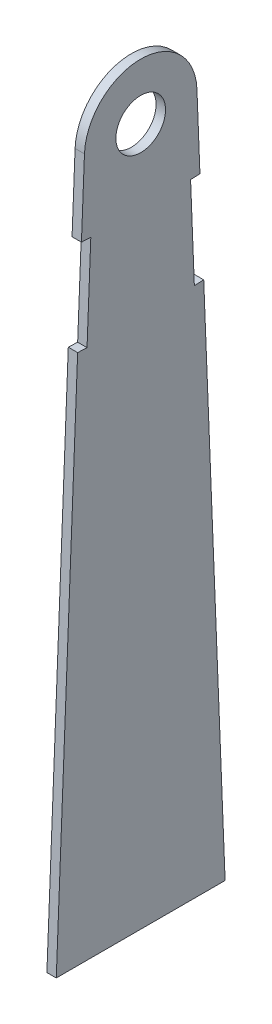
ISO-10303-21;
HEADER;
FILE_DESCRIPTION(('STEP AP214'),'2;1');
FILE_NAME('part.step','',(''),(''),'','','');
FILE_SCHEMA(('AUTOMOTIVE_DESIGN { 1 0 10303 214 1 1 1 1 }'));
ENDSEC;
DATA;
#1=APPLICATION_CONTEXT('core data for automotive mechanical design processes');
#2=APPLICATION_PROTOCOL_DEFINITION('international standard','automotive_design',2000,#1);
#3=PRODUCT_CONTEXT('',#1,'mechanical');
#4=PRODUCT('Part','Part','',(#3));
#5=PRODUCT_RELATED_PRODUCT_CATEGORY('part','',(#4));
#6=PRODUCT_DEFINITION_FORMATION('','',#4);
#7=PRODUCT_DEFINITION_CONTEXT('part definition',#1,'design');
#8=PRODUCT_DEFINITION('design','',#6,#7);
#9=PRODUCT_DEFINITION_SHAPE('','',#8);
#10=(LENGTH_UNIT() NAMED_UNIT(*) SI_UNIT(.MILLI.,.METRE.));
#11=(NAMED_UNIT(*) PLANE_ANGLE_UNIT() SI_UNIT($,.RADIAN.));
#12=(NAMED_UNIT(*) SI_UNIT($,.STERADIAN.) SOLID_ANGLE_UNIT());
#13=UNCERTAINTY_MEASURE_WITH_UNIT(LENGTH_MEASURE(1.E-05),#10,'distance_accuracy_value','');
#14=(GEOMETRIC_REPRESENTATION_CONTEXT(3) GLOBAL_UNCERTAINTY_ASSIGNED_CONTEXT((#13)) GLOBAL_UNIT_ASSIGNED_CONTEXT((#10,
#11,#12)) REPRESENTATION_CONTEXT('',''));
#15=CARTESIAN_POINT('',(0.,0.,0.));
#16=DIRECTION('',(0.,0.,1.));
#17=DIRECTION('',(1.,0.,0.));
#18=AXIS2_PLACEMENT_3D('',#15,#16,#17);
#19=CARTESIAN_POINT('',(1.5875,0.38341424361724,-9.51727999576515));
#20=DIRECTION('',(0.,-0.0402534638968231,0.999189500867732));
#21=DIRECTION('',(0.,-0.999189500867732,-0.0402534638968231));
#22=AXIS2_PLACEMENT_3D('',#19,#20,#21);
#23=PLANE('',#22);
#24=DIRECTION('',(0.,0.999189500867732,0.0402534638968231));
#25=VECTOR('',#24,1.);
#26=CARTESIAN_POINT('',(0.,0.38341424361724,-9.51727999576515));
#27=LINE('',#26,#25);
#28=CARTESIAN_POINT('',(0.,-12.306292417403,-10.0284989872548));
#29=VERTEX_POINT('',#28);
#30=CARTESIAN_POINT('',(0.,0.38341424361724,-9.51727999576515));
#31=VERTEX_POINT('',#30);
#32=EDGE_CURVE('E158',#29,#31,#27,.T.);
#33=ORIENTED_EDGE('',*,*,#32,.T.);
#34=DIRECTION('',(-1.,0.,0.));
#35=VECTOR('',#34,1.);
#36=CARTESIAN_POINT('',(1.5875,0.38341424361724,-9.51727999576515));
#37=LINE('',#36,#35);
#38=CARTESIAN_POINT('',(1.5875,0.38341424361724,-9.51727999576515));
#39=VERTEX_POINT('',#38);
#40=EDGE_CURVE('E11',#39,#31,#37,.T.);
#41=ORIENTED_EDGE('',*,*,#40,.F.);
#42=DIRECTION('',(0.,0.999189500867732,0.0402534638968231));
#43=VECTOR('',#42,1.);
#44=CARTESIAN_POINT('',(1.5875,0.38341424361724,-9.51727999576515));
#45=LINE('',#44,#43);
#46=CARTESIAN_POINT('',(1.5875,-12.306292417403,-10.0284989872548));
#47=VERTEX_POINT('',#46);
#48=EDGE_CURVE('E187',#47,#39,#45,.T.);
#49=ORIENTED_EDGE('',*,*,#48,.F.);
#50=DIRECTION('',(-1.,0.,0.));
#51=VECTOR('',#50,1.);
#52=CARTESIAN_POINT('',(1.5875,-12.306292417403,-10.0284989872548));
#53=LINE('',#52,#51);
#54=EDGE_CURVE('E52',#47,#29,#53,.T.);
#55=ORIENTED_EDGE('',*,*,#54,.T.);
#56=EDGE_LOOP('',(#33,#41,#49,#55));
#57=FACE_BOUND('',#56,.T.);
#58=ADVANCED_FACE('F35',(#57),#23,.F.);
#59=CARTESIAN_POINT('',(1.5875,0.,0.));
#60=DIRECTION('',(-1.,0.,0.));
#61=DIRECTION('',(0.,0.,1.));
#62=AXIS2_PLACEMENT_3D('',#59,#60,#61);
#63=CYLINDRICAL_SURFACE('',#62,9.525);
#64=CARTESIAN_POINT('',(0.,0.,0.));
#65=DIRECTION('',(1.,0.,0.));
#66=DIRECTION('',(0.,0.,-1.));
#67=AXIS2_PLACEMENT_3D('',#64,#65,#66);
#68=CIRCLE('',#67,9.525);
#69=CARTESIAN_POINT('',(0.,0.383414243617209,9.51727999576515));
#70=VERTEX_POINT('',#69);
#71=EDGE_CURVE('E160',#31,#70,#68,.T.);
#72=ORIENTED_EDGE('',*,*,#71,.T.);
#73=DIRECTION('',(-1.,0.,0.));
#74=VECTOR('',#73,1.);
#75=CARTESIAN_POINT('',(1.5875,0.383414243617209,9.51727999576515));
#76=LINE('',#75,#74);
#77=CARTESIAN_POINT('',(1.5875,0.383414243617209,9.51727999576515));
#78=VERTEX_POINT('',#77);
#79=EDGE_CURVE('E44',#78,#70,#76,.T.);
#80=ORIENTED_EDGE('',*,*,#79,.F.);
#81=CARTESIAN_POINT('',(1.5875,0.,0.));
#82=DIRECTION('',(1.,0.,0.));
#83=DIRECTION('',(0.,0.,-1.));
#84=AXIS2_PLACEMENT_3D('',#81,#82,#83);
#85=CIRCLE('',#84,9.525);
#86=EDGE_CURVE('E103',#39,#78,#85,.T.);
#87=ORIENTED_EDGE('',*,*,#86,.F.);
#88=ORIENTED_EDGE('',*,*,#40,.T.);
#89=EDGE_LOOP('',(#72,#80,#87,#88));
#90=FACE_BOUND('',#89,.T.);
#91=ADVANCED_FACE('F37',(#90),#63,.T.);
#92=CARTESIAN_POINT('',(1.5875,0.383414243617209,9.51727999576515));
#93=DIRECTION('',(0.,0.0402534638968198,0.999189500867732));
#94=DIRECTION('',(0.,-0.999189500867732,0.0402534638968198));
#95=AXIS2_PLACEMENT_3D('',#92,#93,#94);
#96=PLANE('',#95);
#97=DIRECTION('',(0.,0.999189500867732,-0.0402534638968198));
#98=VECTOR('',#97,1.);
#99=CARTESIAN_POINT('',(0.,0.383414243617209,9.51727999576515));
#100=LINE('',#99,#98);
#101=CARTESIAN_POINT('',(0.,-12.306292417403,10.0284989872548));
#102=VERTEX_POINT('',#101);
#103=EDGE_CURVE('E165',#102,#70,#100,.T.);
#104=ORIENTED_EDGE('',*,*,#103,.F.);
#105=DIRECTION('',(-1.,0.,0.));
#106=VECTOR('',#105,1.);
#107=CARTESIAN_POINT('',(1.5875,-12.306292417403,10.0284989872548));
#108=LINE('',#107,#106);
#109=CARTESIAN_POINT('',(1.5875,-12.306292417403,10.0284989872548));
#110=VERTEX_POINT('',#109);
#111=EDGE_CURVE('E201',#110,#102,#108,.T.);
#112=ORIENTED_EDGE('',*,*,#111,.F.);
#113=DIRECTION('',(0.,0.999189500867732,-0.0402534638968198));
#114=VECTOR('',#113,1.);
#115=CARTESIAN_POINT('',(1.5875,0.383414243617209,9.51727999576515));
#116=LINE('',#115,#114);
#117=EDGE_CURVE('E207',#110,#78,#116,.T.);
#118=ORIENTED_EDGE('',*,*,#117,.T.);
#119=ORIENTED_EDGE('',*,*,#79,.T.);
#120=EDGE_LOOP('',(#104,#112,#118,#119));
#121=FACE_BOUND('',#120,.T.);
#122=ADVANCED_FACE('F205',(#121),#96,.T.);
#123=CARTESIAN_POINT('',(1.5875,-12.6897066610202,0.511218991489607));
#124=DIRECTION('',(0.,0.999189500867732,-0.0402534638968195));
#125=DIRECTION('',(0.,0.0402534638968195,0.999189500867732));
#126=AXIS2_PLACEMENT_3D('',#123,#124,#125);
#127=PLANE('',#126);
#128=DIRECTION('',(0.,-0.0402534638968195,-0.999189500867732));
#129=VECTOR('',#128,1.);
#130=CARTESIAN_POINT('',(0.,-12.6897066610202,0.511218991489607));
#131=LINE('',#130,#129);
#132=CARTESIAN_POINT('',(0.,-12.3701947913392,8.44228565462724));
#133=VERTEX_POINT('',#132);
#134=EDGE_CURVE('E168',#102,#133,#131,.T.);
#135=ORIENTED_EDGE('',*,*,#134,.T.);
#136=DIRECTION('',(-1.,0.,0.));
#137=VECTOR('',#136,1.);
#138=CARTESIAN_POINT('',(1.5875,-12.3701947913392,8.44228565462724));
#139=LINE('',#138,#137);
#140=CARTESIAN_POINT('',(1.5875,-12.3701947913392,8.44228565462724));
#141=VERTEX_POINT('',#140);
#142=EDGE_CURVE('E199',#141,#133,#139,.T.);
#143=ORIENTED_EDGE('',*,*,#142,.F.);
#144=DIRECTION('',(0.,-0.0402534638968195,-0.999189500867732));
#145=VECTOR('',#144,1.);
#146=CARTESIAN_POINT('',(1.5875,-12.6897066610202,0.511218991489607));
#147=LINE('',#146,#145);
#148=EDGE_CURVE('E218',#110,#141,#147,.T.);
#149=ORIENTED_EDGE('',*,*,#148,.F.);
#150=ORIENTED_EDGE('',*,*,#111,.T.);
#151=EDGE_LOOP('',(#135,#143,#149,#150));
#152=FACE_BOUND('',#151,.T.);
#153=ADVANCED_FACE('F215',(#152),#127,.F.);
#154=CARTESIAN_POINT('',(1.5875,0.319511869681007,7.93106666313763));
#155=DIRECTION('',(0.,0.0402534638968198,0.999189500867732));
#156=DIRECTION('',(0.,-0.999189500867732,0.0402534638968198));
#157=AXIS2_PLACEMENT_3D('',#154,#155,#156);
#158=PLANE('',#157);
#159=DIRECTION('',(0.,0.999189500867732,-0.0402534638968198));
#160=VECTOR('',#159,1.);
#161=CARTESIAN_POINT('',(0.,0.319511869681007,7.93106666313763));
#162=LINE('',#161,#160);
#163=CARTESIAN_POINT('',(0.,-28.2323281176144,9.08130939398925));
#164=VERTEX_POINT('',#163);
#165=EDGE_CURVE('E172',#164,#133,#162,.T.);
#166=ORIENTED_EDGE('',*,*,#165,.F.);
#167=DIRECTION('',(-1.,0.,0.));
#168=VECTOR('',#167,1.);
#169=CARTESIAN_POINT('',(1.5875,-28.2323281176144,9.08130939398925));
#170=LINE('',#169,#168);
#171=CARTESIAN_POINT('',(1.5875,-28.2323281176144,9.08130939398925));
#172=VERTEX_POINT('',#171);
#173=EDGE_CURVE('E197',#172,#164,#170,.T.);
#174=ORIENTED_EDGE('',*,*,#173,.F.);
#175=DIRECTION('',(0.,0.999189500867732,-0.0402534638968198));
#176=VECTOR('',#175,1.);
#177=CARTESIAN_POINT('',(1.5875,0.319511869681007,7.93106666313763));
#178=LINE('',#177,#176);
#179=EDGE_CURVE('E220',#172,#141,#178,.T.);
#180=ORIENTED_EDGE('',*,*,#179,.T.);
#181=ORIENTED_EDGE('',*,*,#142,.T.);
#182=EDGE_LOOP('',(#166,#174,#180,#181));
#183=FACE_BOUND('',#182,.T.);
#184=ADVANCED_FACE('F237',(#183),#158,.T.);
#185=CARTESIAN_POINT('',(1.5875,-28.5518399872954,1.15024273085158));
#186=DIRECTION('',(0.,0.999189500867732,-0.0402534638968183));
#187=DIRECTION('',(0.,0.0402534638968183,0.999189500867732));
#188=AXIS2_PLACEMENT_3D('',#185,#186,#187);
#189=PLANE('',#188);
#190=DIRECTION('',(0.,-0.0402534638968183,-0.999189500867732));
#191=VECTOR('',#190,1.);
#192=CARTESIAN_POINT('',(0.,-28.5518399872954,1.15024273085158));
#193=LINE('',#192,#191);
#194=CARTESIAN_POINT('',(0.,-28.1684257436782,10.6675227266168));
#195=VERTEX_POINT('',#194);
#196=EDGE_CURVE('E175',#195,#164,#193,.T.);
#197=ORIENTED_EDGE('',*,*,#196,.F.);
#198=DIRECTION('',(-1.,0.,0.));
#199=VECTOR('',#198,1.);
#200=CARTESIAN_POINT('',(1.5875,-28.1684257436782,10.6675227266168));
#201=LINE('',#200,#199);
#202=CARTESIAN_POINT('',(1.5875,-28.1684257436782,10.6675227266168));
#203=VERTEX_POINT('',#202);
#204=EDGE_CURVE('E195',#203,#195,#201,.T.);
#205=ORIENTED_EDGE('',*,*,#204,.F.);
#206=DIRECTION('',(0.,-0.0402534638968183,-0.999189500867732));
#207=VECTOR('',#206,1.);
#208=CARTESIAN_POINT('',(1.5875,-28.5518399872954,1.15024273085158));
#209=LINE('',#208,#207);
#210=EDGE_CURVE('E227',#203,#172,#209,.T.);
#211=ORIENTED_EDGE('',*,*,#210,.T.);
#212=ORIENTED_EDGE('',*,*,#173,.T.);
#213=EDGE_LOOP('',(#197,#205,#211,#212));
#214=FACE_BOUND('',#213,.T.);
#215=ADVANCED_FACE('F274',(#214),#189,.T.);
#216=CARTESIAN_POINT('',(0.,-118.025122156577,14.2874999999998));
#217=VERTEX_POINT('',#216);
#218=EDGE_CURVE('E169',#217,#195,#100,.T.);
#219=ORIENTED_EDGE('',*,*,#218,.F.);
#220=DIRECTION('',(-1.,0.,0.));
#221=VECTOR('',#220,1.);
#222=CARTESIAN_POINT('',(1.5875,-118.025122156577,14.2874999999998));
#223=LINE('',#222,#221);
#224=CARTESIAN_POINT('',(1.5875,-118.025122156577,14.2874999999998));
#225=VERTEX_POINT('',#224);
#226=EDGE_CURVE('E193',#225,#217,#223,.T.);
#227=ORIENTED_EDGE('',*,*,#226,.F.);
#228=EDGE_CURVE('E223',#225,#203,#116,.T.);
#229=ORIENTED_EDGE('',*,*,#228,.T.);
#230=ORIENTED_EDGE('',*,*,#204,.T.);
#231=EDGE_LOOP('',(#219,#227,#229,#230));
#232=FACE_BOUND('',#231,.T.);
#233=ADVANCED_FACE('F270',(#232),#96,.T.);
#234=CARTESIAN_POINT('',(1.5875,-118.025122156577,0.));
#235=DIRECTION('',(0.,-1.,0.));
#236=DIRECTION('',(0.,0.,-1.));
#237=AXIS2_PLACEMENT_3D('',#234,#235,#236);
#238=PLANE('',#237);
#239=DIRECTION('',(0.,0.,1.));
#240=VECTOR('',#239,1.);
#241=CARTESIAN_POINT('',(0.,-118.025122156577,0.));
#242=LINE('',#241,#240);
#243=CARTESIAN_POINT('',(0.,-118.025122156577,-14.2875000000002));
#244=VERTEX_POINT('',#243);
#245=EDGE_CURVE('E178',#244,#217,#242,.T.);
#246=ORIENTED_EDGE('',*,*,#245,.F.);
#247=DIRECTION('',(-1.,0.,0.));
#248=VECTOR('',#247,1.);
#249=CARTESIAN_POINT('',(1.5875,-118.025122156577,-14.2875000000002));
#250=LINE('',#249,#248);
#251=CARTESIAN_POINT('',(1.5875,-118.025122156577,-14.2875000000002));
#252=VERTEX_POINT('',#251);
#253=EDGE_CURVE('E191',#252,#244,#250,.T.);
#254=ORIENTED_EDGE('',*,*,#253,.F.);
#255=DIRECTION('',(0.,0.,1.));
#256=VECTOR('',#255,1.);
#257=CARTESIAN_POINT('',(1.5875,-118.025122156577,0.));
#258=LINE('',#257,#256);
#259=EDGE_CURVE('E226',#252,#225,#258,.T.);
#260=ORIENTED_EDGE('',*,*,#259,.T.);
#261=ORIENTED_EDGE('',*,*,#226,.T.);
#262=EDGE_LOOP('',(#246,#254,#260,#261));
#263=FACE_BOUND('',#262,.T.);
#264=ADVANCED_FACE('F240',(#263),#238,.T.);
#265=CARTESIAN_POINT('',(0.,-28.1684257436782,-10.6675227266169));
#266=VERTEX_POINT('',#265);
#267=EDGE_CURVE('E162',#244,#266,#27,.T.);
#268=ORIENTED_EDGE('',*,*,#267,.T.);
#269=DIRECTION('',(-1.,0.,0.));
#270=VECTOR('',#269,1.);
#271=CARTESIAN_POINT('',(1.5875,-28.1684257436782,-10.6675227266169));
#272=LINE('',#271,#270);
#273=CARTESIAN_POINT('',(1.5875,-28.1684257436782,-10.6675227266169));
#274=VERTEX_POINT('',#273);
#275=EDGE_CURVE('E150',#274,#266,#272,.T.);
#276=ORIENTED_EDGE('',*,*,#275,.F.);
#277=EDGE_CURVE('E138',#252,#274,#45,.T.);
#278=ORIENTED_EDGE('',*,*,#277,.F.);
#279=ORIENTED_EDGE('',*,*,#253,.T.);
#280=EDGE_LOOP('',(#268,#276,#278,#279));
#281=FACE_BOUND('',#280,.T.);
#282=ADVANCED_FACE('F244',(#281),#23,.F.);
#283=CARTESIAN_POINT('',(1.5875,-28.5518399872954,-1.15024273085177));
#284=DIRECTION('',(0.,-0.999189500867732,-0.0402534638968248));
#285=DIRECTION('',(0.,0.0402534638968248,-0.999189500867732));
#286=AXIS2_PLACEMENT_3D('',#283,#284,#285);
#287=PLANE('',#286);
#288=DIRECTION('',(0.,-0.0402534638968248,0.999189500867732));
#289=VECTOR('',#288,1.);
#290=CARTESIAN_POINT('',(0.,-28.5518399872954,-1.15024273085177));
#291=LINE('',#290,#289);
#292=CARTESIAN_POINT('',(0.,-28.2323281176144,-9.08130939398934));
#293=VERTEX_POINT('',#292);
#294=EDGE_CURVE('E147',#266,#293,#291,.T.);
#295=ORIENTED_EDGE('',*,*,#294,.T.);
#296=DIRECTION('',(-1.,0.,0.));
#297=VECTOR('',#296,1.);
#298=CARTESIAN_POINT('',(1.5875,-28.2323281176144,-9.08130939398934));
#299=LINE('',#298,#297);
#300=CARTESIAN_POINT('',(1.5875,-28.2323281176144,-9.08130939398934));
#301=VERTEX_POINT('',#300);
#302=EDGE_CURVE('E144',#301,#293,#299,.T.);
#303=ORIENTED_EDGE('',*,*,#302,.F.);
#304=DIRECTION('',(0.,-0.0402534638968248,0.999189500867732));
#305=VECTOR('',#304,1.);
#306=CARTESIAN_POINT('',(1.5875,-28.5518399872954,-1.15024273085177));
#307=LINE('',#306,#305);
#308=EDGE_CURVE('E130',#274,#301,#307,.T.);
#309=ORIENTED_EDGE('',*,*,#308,.F.);
#310=ORIENTED_EDGE('',*,*,#275,.T.);
#311=EDGE_LOOP('',(#295,#303,#309,#310));
#312=FACE_BOUND('',#311,.T.);
#313=ADVANCED_FACE('F145',(#312),#287,.F.);
#314=CARTESIAN_POINT('',(1.5875,0.319511869681033,-7.93106666313762));
#315=DIRECTION('',(0.,-0.040253463896823,0.999189500867732));
#316=DIRECTION('',(0.,-0.999189500867732,-0.040253463896823));
#317=AXIS2_PLACEMENT_3D('',#314,#315,#316);
#318=PLANE('',#317);
#319=DIRECTION('',(0.,0.999189500867732,0.040253463896823));
#320=VECTOR('',#319,1.);
#321=CARTESIAN_POINT('',(0.,0.319511869681033,-7.93106666313762));
#322=LINE('',#321,#320);
#323=CARTESIAN_POINT('',(0.,-12.3701947913392,-8.44228565462727));
#324=VERTEX_POINT('',#323);
#325=EDGE_CURVE('E182',#293,#324,#322,.T.);
#326=ORIENTED_EDGE('',*,*,#325,.T.);
#327=DIRECTION('',(-1.,0.,0.));
#328=VECTOR('',#327,1.);
#329=CARTESIAN_POINT('',(1.5875,-12.3701947913392,-8.44228565462727));
#330=LINE('',#329,#328);
#331=CARTESIAN_POINT('',(1.5875,-12.3701947913392,-8.44228565462727));
#332=VERTEX_POINT('',#331);
#333=EDGE_CURVE('E91',#332,#324,#330,.T.);
#334=ORIENTED_EDGE('',*,*,#333,.F.);
#335=DIRECTION('',(0.,0.999189500867732,0.040253463896823));
#336=VECTOR('',#335,1.);
#337=CARTESIAN_POINT('',(1.5875,0.319511869681033,-7.93106666313762));
#338=LINE('',#337,#336);
#339=EDGE_CURVE('E135',#301,#332,#338,.T.);
#340=ORIENTED_EDGE('',*,*,#339,.F.);
#341=ORIENTED_EDGE('',*,*,#302,.T.);
#342=EDGE_LOOP('',(#326,#334,#340,#341));
#343=FACE_BOUND('',#342,.T.);
#344=ADVANCED_FACE('F152',(#343),#318,.F.);
#345=CARTESIAN_POINT('',(1.5875,-12.6897066610202,-0.511218991489619));
#346=DIRECTION('',(0.,-0.999189500867732,-0.0402534638968205));
#347=DIRECTION('',(0.,0.0402534638968205,-0.999189500867732));
#348=AXIS2_PLACEMENT_3D('',#345,#346,#347);
#349=PLANE('',#348);
#350=DIRECTION('',(0.,-0.0402534638968205,0.999189500867732));
#351=VECTOR('',#350,1.);
#352=CARTESIAN_POINT('',(0.,-12.6897066610202,-0.511218991489619));
#353=LINE('',#352,#351);
#354=EDGE_CURVE('E184',#29,#324,#353,.T.);
#355=ORIENTED_EDGE('',*,*,#354,.F.);
#356=ORIENTED_EDGE('',*,*,#54,.F.);
#357=DIRECTION('',(0.,-0.0402534638968205,0.999189500867732));
#358=VECTOR('',#357,1.);
#359=CARTESIAN_POINT('',(1.5875,-12.6897066610202,-0.511218991489619));
#360=LINE('',#359,#358);
#361=EDGE_CURVE('E153',#47,#332,#360,.T.);
#362=ORIENTED_EDGE('',*,*,#361,.T.);
#363=ORIENTED_EDGE('',*,*,#333,.T.);
#364=EDGE_LOOP('',(#355,#356,#362,#363));
#365=FACE_BOUND('',#364,.T.);
#366=ADVANCED_FACE('F247',(#365),#349,.T.);
#367=CARTESIAN_POINT('',(1.5875,0.,0.));
#368=DIRECTION('',(1.,0.,0.));
#369=DIRECTION('',(0.,0.,-1.));
#370=AXIS2_PLACEMENT_3D('',#367,#368,#369);
#371=PLANE('',#370);
#372=CARTESIAN_POINT('',(1.5875,0.,0.));
#373=DIRECTION('',(1.,0.,0.));
#374=DIRECTION('',(0.,0.,-1.));
#375=AXIS2_PLACEMENT_3D('',#372,#373,#374);
#376=CIRCLE('',#375,4.2);
#377=CARTESIAN_POINT('',(1.5875,0.,-4.2));
#378=VERTEX_POINT('',#377);
#379=EDGE_CURVE('E373',#378,#378,#376,.T.);
#380=ORIENTED_EDGE('',*,*,#379,.F.);
#381=EDGE_LOOP('',(#380));
#382=FACE_BOUND('',#381,.T.);
#383=ORIENTED_EDGE('',*,*,#48,.T.);
#384=ORIENTED_EDGE('',*,*,#86,.T.);
#385=ORIENTED_EDGE('',*,*,#117,.F.);
#386=ORIENTED_EDGE('',*,*,#148,.T.);
#387=ORIENTED_EDGE('',*,*,#179,.F.);
#388=ORIENTED_EDGE('',*,*,#210,.F.);
#389=ORIENTED_EDGE('',*,*,#228,.F.);
#390=ORIENTED_EDGE('',*,*,#259,.F.);
#391=ORIENTED_EDGE('',*,*,#277,.T.);
#392=ORIENTED_EDGE('',*,*,#308,.T.);
#393=ORIENTED_EDGE('',*,*,#339,.T.);
#394=ORIENTED_EDGE('',*,*,#361,.F.);
#395=EDGE_LOOP('',(#383,#384,#385,#386,#387,#388,#389,#390,#391,#392,#393,#394));
#396=FACE_BOUND('',#395,.T.);
#397=ADVANCED_FACE('F132',(#382,#396),#371,.T.);
#398=CARTESIAN_POINT('',(0.,0.,0.));
#399=DIRECTION('',(1.,0.,0.));
#400=DIRECTION('',(0.,0.,-1.));
#401=AXIS2_PLACEMENT_3D('',#398,#399,#400);
#402=PLANE('',#401);
#403=CARTESIAN_POINT('',(0.,0.,0.));
#404=DIRECTION('',(1.,0.,0.));
#405=DIRECTION('',(0.,0.,-1.));
#406=AXIS2_PLACEMENT_3D('',#403,#404,#405);
#407=CIRCLE('',#406,4.2);
#408=CARTESIAN_POINT('',(0.,0.,-4.2));
#409=VERTEX_POINT('',#408);
#410=EDGE_CURVE('E161',#409,#409,#407,.T.);
#411=ORIENTED_EDGE('',*,*,#410,.T.);
#412=EDGE_LOOP('',(#411));
#413=FACE_BOUND('',#412,.T.);
#414=ORIENTED_EDGE('',*,*,#32,.F.);
#415=ORIENTED_EDGE('',*,*,#354,.T.);
#416=ORIENTED_EDGE('',*,*,#325,.F.);
#417=ORIENTED_EDGE('',*,*,#294,.F.);
#418=ORIENTED_EDGE('',*,*,#267,.F.);
#419=ORIENTED_EDGE('',*,*,#245,.T.);
#420=ORIENTED_EDGE('',*,*,#218,.T.);
#421=ORIENTED_EDGE('',*,*,#196,.T.);
#422=ORIENTED_EDGE('',*,*,#165,.T.);
#423=ORIENTED_EDGE('',*,*,#134,.F.);
#424=ORIENTED_EDGE('',*,*,#103,.T.);
#425=ORIENTED_EDGE('',*,*,#71,.F.);
#426=EDGE_LOOP('',(#414,#415,#416,#417,#418,#419,#420,#421,#422,#423,#424,#425));
#427=FACE_BOUND('',#426,.T.);
#428=ADVANCED_FACE('F211',(#413,#427),#402,.F.);
#429=CARTESIAN_POINT('',(1.5875,0.,0.));
#430=DIRECTION('',(1.,0.,0.));
#431=DIRECTION('',(0.,0.,-1.));
#432=AXIS2_PLACEMENT_3D('',#429,#430,#431);
#433=CYLINDRICAL_SURFACE('',#432,4.2);
#434=ORIENTED_EDGE('',*,*,#410,.F.);
#435=EDGE_LOOP('',(#434));
#436=FACE_BOUND('',#435,.T.);
#437=ORIENTED_EDGE('',*,*,#379,.T.);
#438=EDGE_LOOP('',(#437));
#439=FACE_BOUND('',#438,.T.);
#440=ADVANCED_FACE('F355',(#436,#439),#433,.F.);
#441=CLOSED_SHELL('',(#58,#91,#122,#153,#184,#215,#233,#264,#282,#313,#344,#366,#397,#428,#440));
#442=MANIFOLD_SOLID_BREP('B2',#441);
#443=ADVANCED_BREP_SHAPE_REPRESENTATION('',(#18,#442),#14);
#444=SHAPE_DEFINITION_REPRESENTATION(#9,#443);
ENDSEC;
END-ISO-10303-21;
